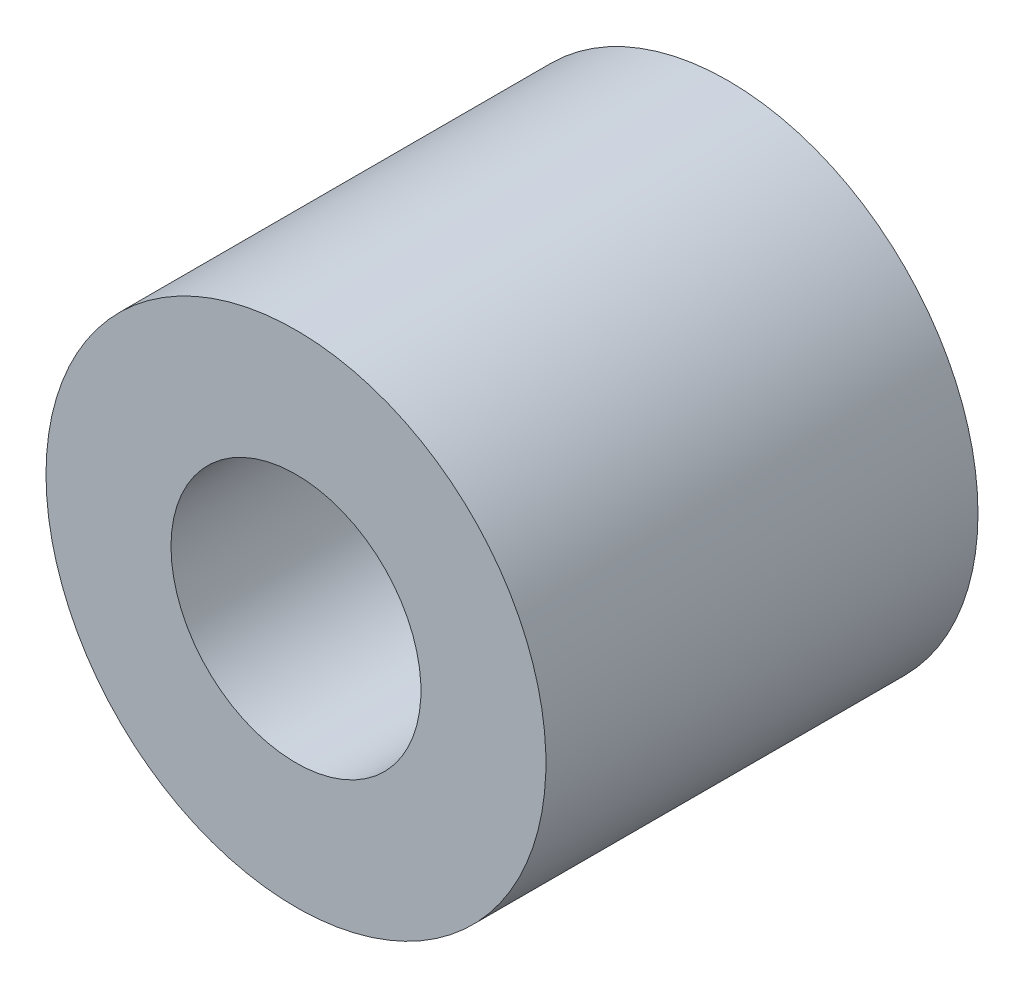
ISO-10303-21;
HEADER;
FILE_DESCRIPTION(('STEP AP214'),'2;1');
FILE_NAME('part.step','',(''),(''),'','','');
FILE_SCHEMA(('AUTOMOTIVE_DESIGN { 1 0 10303 214 1 1 1 1 }'));
ENDSEC;
DATA;
#1=APPLICATION_CONTEXT('core data for automotive mechanical design processes');
#2=APPLICATION_PROTOCOL_DEFINITION('international standard','automotive_design',2000,#1);
#3=PRODUCT_CONTEXT('',#1,'mechanical');
#4=PRODUCT('Part','Part','',(#3));
#5=PRODUCT_RELATED_PRODUCT_CATEGORY('part','',(#4));
#6=PRODUCT_DEFINITION_FORMATION('','',#4);
#7=PRODUCT_DEFINITION_CONTEXT('part definition',#1,'design');
#8=PRODUCT_DEFINITION('design','',#6,#7);
#9=PRODUCT_DEFINITION_SHAPE('','',#8);
#10=(LENGTH_UNIT() NAMED_UNIT(*) SI_UNIT(.MILLI.,.METRE.));
#11=(NAMED_UNIT(*) PLANE_ANGLE_UNIT() SI_UNIT($,.RADIAN.));
#12=(NAMED_UNIT(*) SI_UNIT($,.STERADIAN.) SOLID_ANGLE_UNIT());
#13=UNCERTAINTY_MEASURE_WITH_UNIT(LENGTH_MEASURE(1.E-05),#10,'distance_accuracy_value','');
#14=(GEOMETRIC_REPRESENTATION_CONTEXT(3) GLOBAL_UNCERTAINTY_ASSIGNED_CONTEXT((#13)) GLOBAL_UNIT_ASSIGNED_CONTEXT((#10,
#11,#12)) REPRESENTATION_CONTEXT('',''));
#15=CARTESIAN_POINT('',(0.,0.,0.));
#16=DIRECTION('',(0.,0.,1.));
#17=DIRECTION('',(1.,0.,0.));
#18=AXIS2_PLACEMENT_3D('',#15,#16,#17);
#19=CARTESIAN_POINT('',(0.,0.,0.));
#20=DIRECTION('',(0.,0.,1.));
#21=DIRECTION('',(1.,0.,0.));
#22=AXIS2_PLACEMENT_3D('',#19,#20,#21);
#23=PLANE('',#22);
#24=CARTESIAN_POINT('',(0.,0.,0.));
#25=DIRECTION('',(0.,0.,1.));
#26=DIRECTION('',(1.,0.,0.));
#27=AXIS2_PLACEMENT_3D('',#24,#25,#26);
#28=CIRCLE('',#27,3.5);
#29=CARTESIAN_POINT('',(3.5,0.,0.));
#30=VERTEX_POINT('',#29);
#31=EDGE_CURVE('E43',#30,#30,#28,.T.);
#32=ORIENTED_EDGE('',*,*,#31,.F.);
#33=EDGE_LOOP('',(#32));
#34=FACE_BOUND('',#33,.T.);
#35=CARTESIAN_POINT('',(0.,0.,0.));
#36=DIRECTION('',(0.,0.,1.));
#37=DIRECTION('',(1.,0.,0.));
#38=AXIS2_PLACEMENT_3D('',#35,#36,#37);
#39=CIRCLE('',#38,1.75);
#40=CARTESIAN_POINT('',(1.75,0.,0.));
#41=VERTEX_POINT('',#40);
#42=EDGE_CURVE('E55',#41,#41,#39,.T.);
#43=ORIENTED_EDGE('',*,*,#42,.T.);
#44=EDGE_LOOP('',(#43));
#45=FACE_BOUND('',#44,.T.);
#46=ADVANCED_FACE('F35',(#34,#45),#23,.F.);
#47=CARTESIAN_POINT('',(0.,0.,15.9494949366117));
#48=DIRECTION('',(0.,0.,-1.));
#49=DIRECTION('',(-1.,0.,0.));
#50=AXIS2_PLACEMENT_3D('',#47,#48,#49);
#51=CYLINDRICAL_SURFACE('',#50,3.5);
#52=CARTESIAN_POINT('',(0.,0.,6.05));
#53=DIRECTION('',(0.,0.,-1.));
#54=DIRECTION('',(-1.,0.,0.));
#55=AXIS2_PLACEMENT_3D('',#52,#53,#54);
#56=CIRCLE('',#55,3.5);
#57=CARTESIAN_POINT('',(-3.5,0.,6.05));
#58=VERTEX_POINT('',#57);
#59=EDGE_CURVE('E49',#58,#58,#56,.T.);
#60=ORIENTED_EDGE('',*,*,#59,.T.);
#61=EDGE_LOOP('',(#60));
#62=FACE_BOUND('',#61,.T.);
#63=ORIENTED_EDGE('',*,*,#31,.T.);
#64=EDGE_LOOP('',(#63));
#65=FACE_BOUND('',#64,.T.);
#66=ADVANCED_FACE('F63',(#62,#65),#51,.T.);
#67=CARTESIAN_POINT('',(0.,0.,15.9494949366117));
#68=DIRECTION('',(0.,0.,-1.));
#69=DIRECTION('',(-1.,0.,0.));
#70=AXIS2_PLACEMENT_3D('',#67,#68,#69);
#71=CYLINDRICAL_SURFACE('',#70,1.75);
#72=CARTESIAN_POINT('',(0.,0.,6.05));
#73=DIRECTION('',(0.,0.,-1.));
#74=DIRECTION('',(-1.,0.,0.));
#75=AXIS2_PLACEMENT_3D('',#72,#73,#74);
#76=CIRCLE('',#75,1.74999999999998);
#77=CARTESIAN_POINT('',(-1.74999999999998,0.,6.05));
#78=VERTEX_POINT('',#77);
#79=EDGE_CURVE('E10',#78,#78,#76,.T.);
#80=ORIENTED_EDGE('',*,*,#79,.F.);
#81=EDGE_LOOP('',(#80));
#82=FACE_BOUND('',#81,.T.);
#83=ORIENTED_EDGE('',*,*,#42,.F.);
#84=EDGE_LOOP('',(#83));
#85=FACE_BOUND('',#84,.T.);
#86=ADVANCED_FACE('F61',(#82,#85),#71,.F.);
#87=CARTESIAN_POINT('',(188.00660482012,15.989725,6.05));
#88=DIRECTION('',(0.,0.,-1.));
#89=DIRECTION('',(-1.,0.,0.));
#90=AXIS2_PLACEMENT_3D('',#87,#88,#89);
#91=PLANE('',#90);
#92=ORIENTED_EDGE('',*,*,#79,.T.);
#93=EDGE_LOOP('',(#92));
#94=FACE_BOUND('',#93,.T.);
#95=ORIENTED_EDGE('',*,*,#59,.F.);
#96=EDGE_LOOP('',(#95));
#97=FACE_BOUND('',#96,.T.);
#98=ADVANCED_FACE('F37',(#94,#97),#91,.F.);
#99=CLOSED_SHELL('',(#46,#66,#86,#98));
#100=MANIFOLD_SOLID_BREP('B2',#99);
#101=ADVANCED_BREP_SHAPE_REPRESENTATION('',(#18,#100),#14);
#102=SHAPE_DEFINITION_REPRESENTATION(#9,#101);
ENDSEC;
END-ISO-10303-21;
